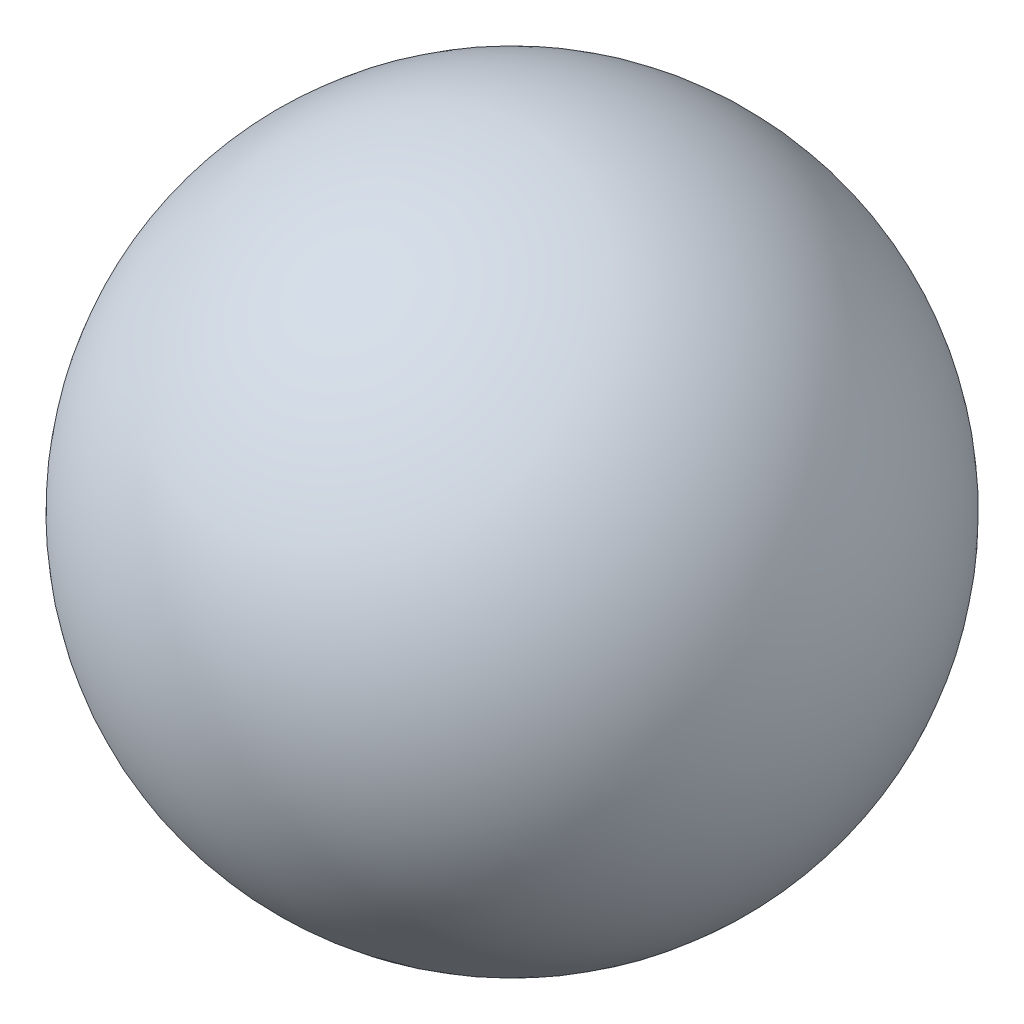
ISO-10303-21;
HEADER;
FILE_DESCRIPTION(('STEP AP214'),'2;1');
FILE_NAME('part.step','',(''),(''),'','','');
FILE_SCHEMA(('AUTOMOTIVE_DESIGN { 1 0 10303 214 1 1 1 1 }'));
ENDSEC;
DATA;
#1=APPLICATION_CONTEXT('core data for automotive mechanical design processes');
#2=APPLICATION_PROTOCOL_DEFINITION('international standard','automotive_design',2000,#1);
#3=PRODUCT_CONTEXT('',#1,'mechanical');
#4=PRODUCT('Part','Part','',(#3));
#5=PRODUCT_RELATED_PRODUCT_CATEGORY('part','',(#4));
#6=PRODUCT_DEFINITION_FORMATION('','',#4);
#7=PRODUCT_DEFINITION_CONTEXT('part definition',#1,'design');
#8=PRODUCT_DEFINITION('design','',#6,#7);
#9=PRODUCT_DEFINITION_SHAPE('','',#8);
#10=(LENGTH_UNIT() NAMED_UNIT(*) SI_UNIT(.MILLI.,.METRE.));
#11=(NAMED_UNIT(*) PLANE_ANGLE_UNIT() SI_UNIT($,.RADIAN.));
#12=(NAMED_UNIT(*) SI_UNIT($,.STERADIAN.) SOLID_ANGLE_UNIT());
#13=UNCERTAINTY_MEASURE_WITH_UNIT(LENGTH_MEASURE(1.E-05),#10,'distance_accuracy_value','');
#14=(GEOMETRIC_REPRESENTATION_CONTEXT(3) GLOBAL_UNCERTAINTY_ASSIGNED_CONTEXT((#13)) GLOBAL_UNIT_ASSIGNED_CONTEXT((#10,
#11,#12)) REPRESENTATION_CONTEXT('',''));
#15=CARTESIAN_POINT('',(0.,0.,0.));
#16=DIRECTION('',(0.,0.,1.));
#17=DIRECTION('',(1.,0.,0.));
#18=AXIS2_PLACEMENT_3D('',#15,#16,#17);
#19=CARTESIAN_POINT('',(64.16,56.3324992532804,40.5049406477675));
#20=DIRECTION('',(0.,0.811906363998105,0.583787680667704));
#21=DIRECTION('',(0.173648177666933,-0.57491863403457,0.799571681985285));
#22=AXIS2_PLACEMENT_3D('',#19,#20,#21);
#23=SPHERICAL_SURFACE('',#22,7.15);
#24=CARTESIAN_POINT('',(64.16,62.1376297558669,44.6790225645416));
#25=VERTEX_POINT('',#24);
#26=VERTEX_LOOP('',#25);
#27=FACE_BOUND('',#26,.T.);
#28=CARTESIAN_POINT('',(64.16,50.527368750694,36.3308587309934));
#29=VERTEX_POINT('',#28);
#30=VERTEX_LOOP('',#29);
#31=FACE_BOUND('',#30,.T.);
#32=ADVANCED_FACE('F15',(#27,#31),#23,.T.);
#33=CLOSED_SHELL('',(#32));
#34=MANIFOLD_SOLID_BREP('B1',#33);
#35=ADVANCED_BREP_SHAPE_REPRESENTATION('',(#18,#34),#14);
#36=SHAPE_DEFINITION_REPRESENTATION(#9,#35);
ENDSEC;
END-ISO-10303-21;
